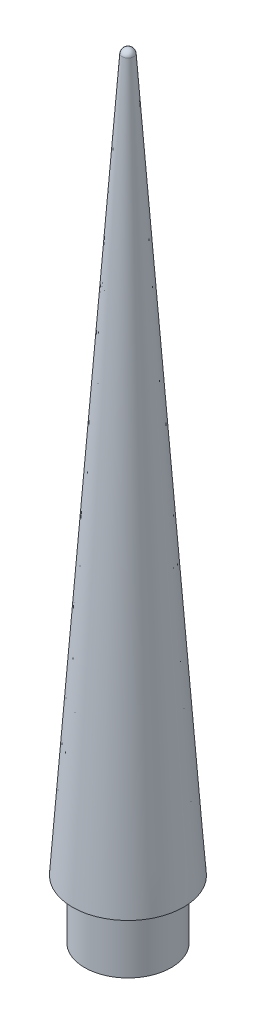
ISO-10303-21;
HEADER;
FILE_DESCRIPTION(('STEP AP214'),'2;1');
FILE_NAME('part.step','',(''),(''),'','','');
FILE_SCHEMA(('AUTOMOTIVE_DESIGN { 1 0 10303 214 1 1 1 1 }'));
ENDSEC;
DATA;
#1=APPLICATION_CONTEXT('core data for automotive mechanical design processes');
#2=APPLICATION_PROTOCOL_DEFINITION('international standard','automotive_design',2000,#1);
#3=PRODUCT_CONTEXT('',#1,'mechanical');
#4=PRODUCT('Part','Part','',(#3));
#5=PRODUCT_RELATED_PRODUCT_CATEGORY('part','',(#4));
#6=PRODUCT_DEFINITION_FORMATION('','',#4);
#7=PRODUCT_DEFINITION_CONTEXT('part definition',#1,'design');
#8=PRODUCT_DEFINITION('design','',#6,#7);
#9=PRODUCT_DEFINITION_SHAPE('','',#8);
#10=(LENGTH_UNIT() NAMED_UNIT(*) SI_UNIT(.MILLI.,.METRE.));
#11=(NAMED_UNIT(*) PLANE_ANGLE_UNIT() SI_UNIT($,.RADIAN.));
#12=(NAMED_UNIT(*) SI_UNIT($,.STERADIAN.) SOLID_ANGLE_UNIT());
#13=UNCERTAINTY_MEASURE_WITH_UNIT(LENGTH_MEASURE(1.E-05),#10,'distance_accuracy_value','');
#14=(GEOMETRIC_REPRESENTATION_CONTEXT(3) GLOBAL_UNCERTAINTY_ASSIGNED_CONTEXT((#13)) GLOBAL_UNIT_ASSIGNED_CONTEXT((#10,
#11,#12)) REPRESENTATION_CONTEXT('',''));
#15=CARTESIAN_POINT('',(0.,0.,0.));
#16=DIRECTION('',(0.,0.,1.));
#17=DIRECTION('',(1.,0.,0.));
#18=AXIS2_PLACEMENT_3D('',#15,#16,#17);
#19=CARTESIAN_POINT('',(0.,12.7,0.));
#20=DIRECTION('',(0.,-1.,0.));
#21=DIRECTION('',(0.,0.,-1.));
#22=AXIS2_PLACEMENT_3D('',#19,#20,#21);
#23=CYLINDRICAL_SURFACE('',#22,9.398);
#24=CARTESIAN_POINT('',(0.,12.7,0.));
#25=DIRECTION('',(0.,1.,0.));
#26=DIRECTION('',(0.,0.,1.));
#27=AXIS2_PLACEMENT_3D('',#24,#25,#26);
#28=CIRCLE('',#27,9.398);
#29=CARTESIAN_POINT('',(0.,12.7,9.398));
#30=VERTEX_POINT('',#29);
#31=EDGE_CURVE('E11',#30,#30,#28,.T.);
#32=ORIENTED_EDGE('',*,*,#31,.F.);
#33=EDGE_LOOP('',(#32));
#34=FACE_BOUND('',#33,.T.);
#35=CARTESIAN_POINT('',(0.,0.,0.));
#36=DIRECTION('',(0.,1.,0.));
#37=DIRECTION('',(0.,0.,1.));
#38=AXIS2_PLACEMENT_3D('',#35,#36,#37);
#39=CIRCLE('',#38,9.398);
#40=CARTESIAN_POINT('',(0.,0.,9.398));
#41=VERTEX_POINT('',#40);
#42=EDGE_CURVE('E52',#41,#41,#39,.T.);
#43=ORIENTED_EDGE('',*,*,#42,.T.);
#44=EDGE_LOOP('',(#43));
#45=FACE_BOUND('',#44,.T.);
#46=ADVANCED_FACE('F49',(#34,#45),#23,.T.);
#47=CARTESIAN_POINT('',(0.,0.,0.));
#48=DIRECTION('',(0.,1.,0.));
#49=DIRECTION('',(0.,0.,1.));
#50=AXIS2_PLACEMENT_3D('',#47,#48,#49);
#51=PLANE('',#50);
#52=CARTESIAN_POINT('',(0.,0.,0.));
#53=DIRECTION('',(0.,-1.,0.));
#54=DIRECTION('',(0.,0.,-1.));
#55=AXIS2_PLACEMENT_3D('',#52,#53,#54);
#56=CIRCLE('',#55,1.72719999999999);
#57=CARTESIAN_POINT('',(0.,0.,-1.72719999999999));
#58=VERTEX_POINT('',#57);
#59=EDGE_CURVE('E72',#58,#58,#56,.T.);
#60=ORIENTED_EDGE('',*,*,#59,.F.);
#61=EDGE_LOOP('',(#60));
#62=FACE_BOUND('',#61,.T.);
#63=ORIENTED_EDGE('',*,*,#42,.F.);
#64=EDGE_LOOP('',(#63));
#65=FACE_BOUND('',#64,.T.);
#66=ADVANCED_FACE('F91',(#62,#65),#51,.F.);
#67=CARTESIAN_POINT('',(0.,12.7,0.));
#68=DIRECTION('',(0.,-1.,0.));
#69=DIRECTION('',(0.,0.,-1.));
#70=AXIS2_PLACEMENT_3D('',#67,#68,#69);
#71=CONICAL_SURFACE('',#70,12.065,0.069813170079777);
#72=CARTESIAN_POINT('',(0.,167.252442079416,0.));
#73=DIRECTION('',(0.,1.,0.));
#74=DIRECTION('',(0.,0.,1.));
#75=AXIS2_PLACEMENT_3D('',#72,#73,#74);
#76=CIRCLE('',#75,1.25764044730179);
#77=CARTESIAN_POINT('',(0.,167.252442079416,1.25764044730179));
#78=VERTEX_POINT('',#77);
#79=EDGE_CURVE('E77',#78,#78,#76,.T.);
#80=ORIENTED_EDGE('',*,*,#79,.F.);
#81=EDGE_LOOP('',(#80));
#82=FACE_BOUND('',#81,.T.);
#83=CARTESIAN_POINT('',(0.,12.7,0.));
#84=DIRECTION('',(0.,1.,0.));
#85=DIRECTION('',(0.,0.,1.));
#86=AXIS2_PLACEMENT_3D('',#83,#84,#85);
#87=CIRCLE('',#86,12.065);
#88=CARTESIAN_POINT('',(0.,12.7,12.065));
#89=VERTEX_POINT('',#88);
#90=EDGE_CURVE('E71',#89,#89,#87,.T.);
#91=ORIENTED_EDGE('',*,*,#90,.T.);
#92=EDGE_LOOP('',(#91));
#93=FACE_BOUND('',#92,.T.);
#94=ADVANCED_FACE('F93',(#82,#93),#71,.T.);
#95=CARTESIAN_POINT('',(0.,167.075692241197,0.));
#96=DIRECTION('',(0.,1.,0.));
#97=DIRECTION('',(0.,0.,-1.));
#98=AXIS2_PLACEMENT_3D('',#95,#96,#97);
#99=SPHERICAL_SURFACE('',#98,1.27);
#100=ORIENTED_EDGE('',*,*,#79,.T.);
#101=EDGE_LOOP('',(#100));
#102=FACE_BOUND('',#101,.T.);
#103=ADVANCED_FACE('F99',(#102),#99,.T.);
#104=CARTESIAN_POINT('',(0.,12.7,0.));
#105=DIRECTION('',(0.,1.,0.));
#106=DIRECTION('',(0.,0.,1.));
#107=AXIS2_PLACEMENT_3D('',#104,#105,#106);
#108=PLANE('',#107);
#109=ORIENTED_EDGE('',*,*,#31,.T.);
#110=EDGE_LOOP('',(#109));
#111=FACE_BOUND('',#110,.T.);
#112=ORIENTED_EDGE('',*,*,#90,.F.);
#113=EDGE_LOOP('',(#112));
#114=FACE_BOUND('',#113,.T.);
#115=ADVANCED_FACE('F64',(#111,#114),#108,.F.);
#116=CARTESIAN_POINT('',(0.,10.16,0.));
#117=DIRECTION('',(0.,-1.,0.));
#118=DIRECTION('',(0.,0.,-1.));
#119=AXIS2_PLACEMENT_3D('',#116,#117,#118);
#120=CONICAL_SURFACE('',#119,1.7272,1.02974425867665);
#121=CARTESIAN_POINT('',(0.,11.1978064611844,0.));
#122=VERTEX_POINT('',#121);
#123=VERTEX_LOOP('',#122);
#124=FACE_BOUND('',#123,.T.);
#125=CARTESIAN_POINT('',(0.,10.16,0.));
#126=DIRECTION('',(0.,-1.,0.));
#127=DIRECTION('',(0.,0.,-1.));
#128=AXIS2_PLACEMENT_3D('',#125,#126,#127);
#129=CIRCLE('',#128,1.7272);
#130=CARTESIAN_POINT('',(0.,10.16,-1.7272));
#131=VERTEX_POINT('',#130);
#132=EDGE_CURVE('E68',#131,#131,#129,.T.);
#133=ORIENTED_EDGE('',*,*,#132,.T.);
#134=EDGE_LOOP('',(#133));
#135=FACE_BOUND('',#134,.T.);
#136=ADVANCED_FACE('F60',(#124,#135),#120,.F.);
#137=CARTESIAN_POINT('',(0.,0.,0.));
#138=DIRECTION('',(0.,-1.,0.));
#139=DIRECTION('',(0.,0.,-1.));
#140=AXIS2_PLACEMENT_3D('',#137,#138,#139);
#141=CYLINDRICAL_SURFACE('',#140,1.72719999999999);
#142=ORIENTED_EDGE('',*,*,#132,.F.);
#143=EDGE_LOOP('',(#142));
#144=FACE_BOUND('',#143,.T.);
#145=ORIENTED_EDGE('',*,*,#59,.T.);
#146=EDGE_LOOP('',(#145));
#147=FACE_BOUND('',#146,.T.);
#148=ADVANCED_FACE('F63',(#144,#147),#141,.F.);
#149=CLOSED_SHELL('',(#46,#66,#94,#103,#115,#136,#148));
#150=MANIFOLD_SOLID_BREP('B2',#149);
#151=ADVANCED_BREP_SHAPE_REPRESENTATION('',(#18,#150),#14);
#152=SHAPE_DEFINITION_REPRESENTATION(#9,#151);
ENDSEC;
END-ISO-10303-21;
